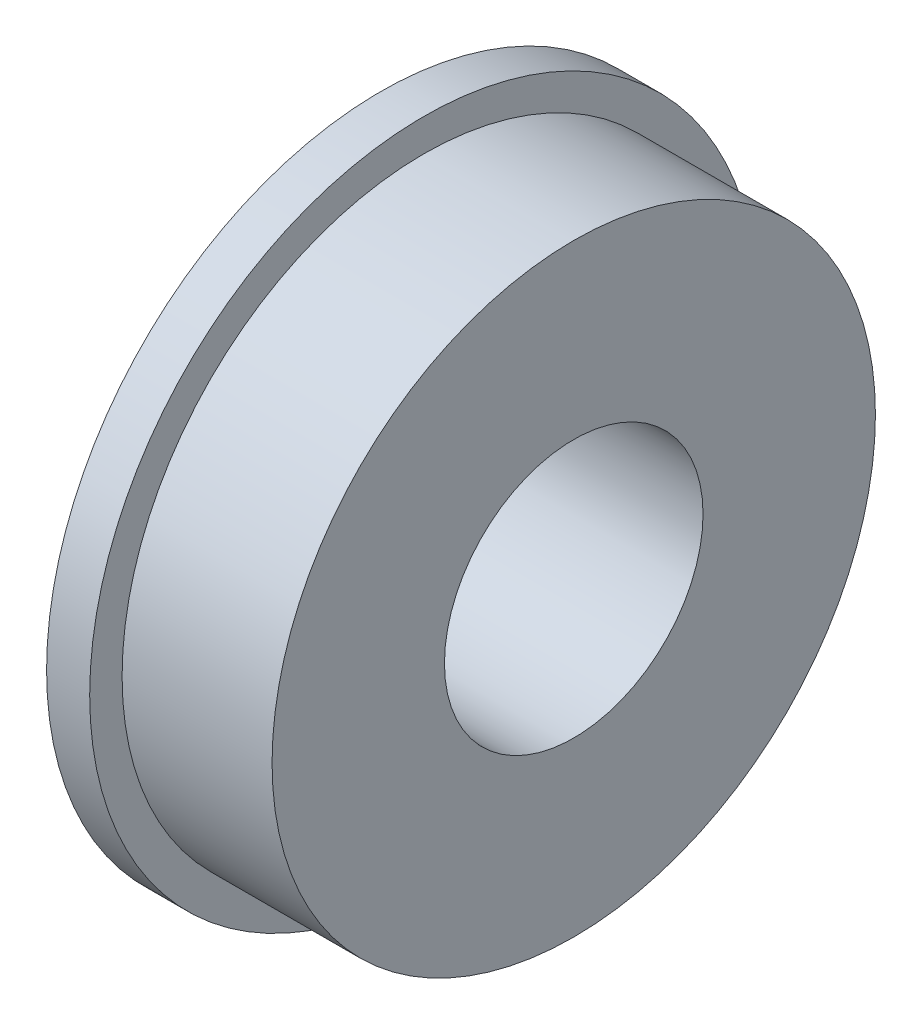
ISO-10303-21;
HEADER;
FILE_DESCRIPTION(('STEP AP214'),'2;1');
FILE_NAME('part.step','',(''),(''),'','','');
FILE_SCHEMA(('AUTOMOTIVE_DESIGN { 1 0 10303 214 1 1 1 1 }'));
ENDSEC;
DATA;
#1=APPLICATION_CONTEXT('core data for automotive mechanical design processes');
#2=APPLICATION_PROTOCOL_DEFINITION('international standard','automotive_design',2000,#1);
#3=PRODUCT_CONTEXT('',#1,'mechanical');
#4=PRODUCT('Part','Part','',(#3));
#5=PRODUCT_RELATED_PRODUCT_CATEGORY('part','',(#4));
#6=PRODUCT_DEFINITION_FORMATION('','',#4);
#7=PRODUCT_DEFINITION_CONTEXT('part definition',#1,'design');
#8=PRODUCT_DEFINITION('design','',#6,#7);
#9=PRODUCT_DEFINITION_SHAPE('','',#8);
#10=(LENGTH_UNIT() NAMED_UNIT(*) SI_UNIT(.MILLI.,.METRE.));
#11=(NAMED_UNIT(*) PLANE_ANGLE_UNIT() SI_UNIT($,.RADIAN.));
#12=(NAMED_UNIT(*) SI_UNIT($,.STERADIAN.) SOLID_ANGLE_UNIT());
#13=UNCERTAINTY_MEASURE_WITH_UNIT(LENGTH_MEASURE(1.E-05),#10,'distance_accuracy_value','');
#14=(GEOMETRIC_REPRESENTATION_CONTEXT(3) GLOBAL_UNCERTAINTY_ASSIGNED_CONTEXT((#13)) GLOBAL_UNIT_ASSIGNED_CONTEXT((#10,
#11,#12)) REPRESENTATION_CONTEXT('',''));
#15=CARTESIAN_POINT('',(0.,0.,0.));
#16=DIRECTION('',(0.,0.,1.));
#17=DIRECTION('',(1.,0.,0.));
#18=AXIS2_PLACEMENT_3D('',#15,#16,#17);
#19=CARTESIAN_POINT('',(0.,0.,0.));
#20=DIRECTION('',(-1.,0.,0.));
#21=DIRECTION('',(0.,0.,1.));
#22=AXIS2_PLACEMENT_3D('',#19,#20,#21);
#23=CYLINDRICAL_SURFACE('',#22,9.906);
#24=CARTESIAN_POINT('',(0.381,0.,0.));
#25=DIRECTION('',(-1.,0.,0.));
#26=DIRECTION('',(0.,0.,1.));
#27=AXIS2_PLACEMENT_3D('',#24,#25,#26);
#28=CIRCLE('',#27,9.906);
#29=CARTESIAN_POINT('',(0.381,0.,9.906));
#30=VERTEX_POINT('',#29);
#31=EDGE_CURVE('E45',#30,#30,#28,.F.);
#32=ORIENTED_EDGE('',*,*,#31,.T.);
#33=EDGE_LOOP('',(#32));
#34=FACE_BOUND('',#33,.T.);
#35=CARTESIAN_POINT('',(0.,0.,0.));
#36=DIRECTION('',(-1.,0.,0.));
#37=DIRECTION('',(0.,0.,1.));
#38=AXIS2_PLACEMENT_3D('',#35,#36,#37);
#39=CIRCLE('',#38,9.906);
#40=CARTESIAN_POINT('',(0.,0.,9.906));
#41=VERTEX_POINT('',#40);
#42=EDGE_CURVE('E17',#41,#41,#39,.T.);
#43=ORIENTED_EDGE('',*,*,#42,.T.);
#44=EDGE_LOOP('',(#43));
#45=FACE_BOUND('',#44,.T.);
#46=ADVANCED_FACE('F14',(#34,#45),#23,.F.);
#47=CARTESIAN_POINT('',(0.,12.3063,0.));
#48=DIRECTION('',(1.,0.,0.));
#49=DIRECTION('',(0.,0.,-1.));
#50=AXIS2_PLACEMENT_3D('',#47,#48,#49);
#51=PLANE('',#50);
#52=CARTESIAN_POINT('',(0.,0.,0.));
#53=DIRECTION('',(-1.,0.,0.));
#54=DIRECTION('',(0.,0.,1.));
#55=AXIS2_PLACEMENT_3D('',#52,#53,#54);
#56=CIRCLE('',#55,12.3063);
#57=CARTESIAN_POINT('',(0.,0.,12.3063));
#58=VERTEX_POINT('',#57);
#59=EDGE_CURVE('E43',#58,#58,#56,.F.);
#60=ORIENTED_EDGE('',*,*,#59,.F.);
#61=EDGE_LOOP('',(#60));
#62=FACE_BOUND('',#61,.T.);
#63=ORIENTED_EDGE('',*,*,#42,.F.);
#64=EDGE_LOOP('',(#63));
#65=FACE_BOUND('',#64,.T.);
#66=ADVANCED_FACE('F53',(#62,#65),#51,.F.);
#67=CARTESIAN_POINT('',(0.381,9.906,0.));
#68=DIRECTION('',(1.,0.,0.));
#69=DIRECTION('',(0.,0.,-1.));
#70=AXIS2_PLACEMENT_3D('',#67,#68,#69);
#71=PLANE('',#70);
#72=ORIENTED_EDGE('',*,*,#31,.F.);
#73=EDGE_LOOP('',(#72));
#74=FACE_BOUND('',#73,.T.);
#75=CARTESIAN_POINT('',(0.381,0.,0.));
#76=DIRECTION('',(-1.,0.,0.));
#77=DIRECTION('',(0.,0.,1.));
#78=AXIS2_PLACEMENT_3D('',#75,#76,#77);
#79=CIRCLE('',#78,6.35);
#80=CARTESIAN_POINT('',(0.381,0.,6.35));
#81=VERTEX_POINT('',#80);
#82=EDGE_CURVE('E40',#81,#81,#79,.T.);
#83=ORIENTED_EDGE('',*,*,#82,.F.);
#84=EDGE_LOOP('',(#83));
#85=FACE_BOUND('',#84,.T.);
#86=ADVANCED_FACE('F55',(#74,#85),#71,.F.);
#87=CARTESIAN_POINT('',(0.,0.,0.));
#88=DIRECTION('',(-1.,0.,0.));
#89=DIRECTION('',(0.,0.,1.));
#90=AXIS2_PLACEMENT_3D('',#87,#88,#89);
#91=CYLINDRICAL_SURFACE('',#90,12.3063);
#92=ORIENTED_EDGE('',*,*,#59,.T.);
#93=EDGE_LOOP('',(#92));
#94=FACE_BOUND('',#93,.T.);
#95=CARTESIAN_POINT('',(1.5875,0.,0.));
#96=DIRECTION('',(-1.,0.,0.));
#97=DIRECTION('',(0.,0.,1.));
#98=AXIS2_PLACEMENT_3D('',#95,#96,#97);
#99=CIRCLE('',#98,12.3063);
#100=CARTESIAN_POINT('',(1.5875,0.,12.3063));
#101=VERTEX_POINT('',#100);
#102=EDGE_CURVE('E37',#101,#101,#99,.T.);
#103=ORIENTED_EDGE('',*,*,#102,.T.);
#104=EDGE_LOOP('',(#103));
#105=FACE_BOUND('',#104,.T.);
#106=ADVANCED_FACE('F62',(#94,#105),#91,.T.);
#107=CARTESIAN_POINT('',(0.,0.,0.));
#108=DIRECTION('',(-1.,0.,0.));
#109=DIRECTION('',(0.,0.,1.));
#110=AXIS2_PLACEMENT_3D('',#107,#108,#109);
#111=CYLINDRICAL_SURFACE('',#110,6.35);
#112=CARTESIAN_POINT('',(0.,0.,0.));
#113=DIRECTION('',(-1.,0.,0.));
#114=DIRECTION('',(0.,0.,1.));
#115=AXIS2_PLACEMENT_3D('',#112,#113,#114);
#116=CIRCLE('',#115,6.35);
#117=CARTESIAN_POINT('',(0.,0.,6.35));
#118=VERTEX_POINT('',#117);
#119=EDGE_CURVE('E34',#118,#118,#116,.F.);
#120=ORIENTED_EDGE('',*,*,#119,.T.);
#121=EDGE_LOOP('',(#120));
#122=FACE_BOUND('',#121,.T.);
#123=ORIENTED_EDGE('',*,*,#82,.T.);
#124=EDGE_LOOP('',(#123));
#125=FACE_BOUND('',#124,.T.);
#126=ADVANCED_FACE('F89',(#122,#125),#111,.T.);
#127=CARTESIAN_POINT('',(1.5875,11.1125,0.));
#128=DIRECTION('',(-1.,0.,0.));
#129=DIRECTION('',(0.,0.,1.));
#130=AXIS2_PLACEMENT_3D('',#127,#128,#129);
#131=PLANE('',#130);
#132=CARTESIAN_POINT('',(1.5875,0.,0.));
#133=DIRECTION('',(-1.,0.,0.));
#134=DIRECTION('',(0.,0.,1.));
#135=AXIS2_PLACEMENT_3D('',#132,#133,#134);
#136=CIRCLE('',#135,11.1125);
#137=CARTESIAN_POINT('',(1.5875,0.,11.1125));
#138=VERTEX_POINT('',#137);
#139=EDGE_CURVE('E31',#138,#138,#136,.F.);
#140=ORIENTED_EDGE('',*,*,#139,.F.);
#141=EDGE_LOOP('',(#140));
#142=FACE_BOUND('',#141,.T.);
#143=ORIENTED_EDGE('',*,*,#102,.F.);
#144=EDGE_LOOP('',(#143));
#145=FACE_BOUND('',#144,.T.);
#146=ADVANCED_FACE('F85',(#142,#145),#131,.F.);
#147=CARTESIAN_POINT('',(0.,6.35,0.));
#148=DIRECTION('',(1.,0.,0.));
#149=DIRECTION('',(0.,0.,-1.));
#150=AXIS2_PLACEMENT_3D('',#147,#148,#149);
#151=PLANE('',#150);
#152=ORIENTED_EDGE('',*,*,#119,.F.);
#153=EDGE_LOOP('',(#152));
#154=FACE_BOUND('',#153,.T.);
#155=CARTESIAN_POINT('',(0.,0.,0.));
#156=DIRECTION('',(-1.,0.,0.));
#157=DIRECTION('',(0.,0.,1.));
#158=AXIS2_PLACEMENT_3D('',#155,#156,#157);
#159=CIRCLE('',#158,4.7625);
#160=CARTESIAN_POINT('',(0.,0.,4.7625));
#161=VERTEX_POINT('',#160);
#162=EDGE_CURVE('E26',#161,#161,#159,.F.);
#163=ORIENTED_EDGE('',*,*,#162,.T.);
#164=EDGE_LOOP('',(#163));
#165=FACE_BOUND('',#164,.T.);
#166=ADVANCED_FACE('F81',(#154,#165),#151,.F.);
#167=CARTESIAN_POINT('',(0.,0.,0.));
#168=DIRECTION('',(-1.,0.,0.));
#169=DIRECTION('',(0.,0.,1.));
#170=AXIS2_PLACEMENT_3D('',#167,#168,#169);
#171=CYLINDRICAL_SURFACE('',#170,11.1125);
#172=ORIENTED_EDGE('',*,*,#139,.T.);
#173=EDGE_LOOP('',(#172));
#174=FACE_BOUND('',#173,.T.);
#175=CARTESIAN_POINT('',(7.112,0.,0.));
#176=DIRECTION('',(-1.,0.,0.));
#177=DIRECTION('',(0.,0.,1.));
#178=AXIS2_PLACEMENT_3D('',#175,#176,#177);
#179=CIRCLE('',#178,11.1125);
#180=CARTESIAN_POINT('',(7.112,0.,11.1125));
#181=VERTEX_POINT('',#180);
#182=EDGE_CURVE('E21',#181,#181,#179,.T.);
#183=ORIENTED_EDGE('',*,*,#182,.T.);
#184=EDGE_LOOP('',(#183));
#185=FACE_BOUND('',#184,.T.);
#186=ADVANCED_FACE('F75',(#174,#185),#171,.T.);
#187=CARTESIAN_POINT('',(0.,0.,0.));
#188=DIRECTION('',(-1.,0.,0.));
#189=DIRECTION('',(0.,0.,1.));
#190=AXIS2_PLACEMENT_3D('',#187,#188,#189);
#191=CYLINDRICAL_SURFACE('',#190,4.7625);
#192=CARTESIAN_POINT('',(7.112,0.,0.));
#193=DIRECTION('',(-1.,0.,0.));
#194=DIRECTION('',(0.,0.,1.));
#195=AXIS2_PLACEMENT_3D('',#192,#193,#194);
#196=CIRCLE('',#195,4.7625);
#197=CARTESIAN_POINT('',(7.112,0.,4.7625));
#198=VERTEX_POINT('',#197);
#199=EDGE_CURVE('E10',#198,#198,#196,.F.);
#200=ORIENTED_EDGE('',*,*,#199,.T.);
#201=EDGE_LOOP('',(#200));
#202=FACE_BOUND('',#201,.T.);
#203=ORIENTED_EDGE('',*,*,#162,.F.);
#204=EDGE_LOOP('',(#203));
#205=FACE_BOUND('',#204,.T.);
#206=ADVANCED_FACE('F69',(#202,#205),#191,.F.);
#207=CARTESIAN_POINT('',(7.112,4.7625,0.));
#208=DIRECTION('',(-1.,0.,0.));
#209=DIRECTION('',(0.,0.,1.));
#210=AXIS2_PLACEMENT_3D('',#207,#208,#209);
#211=PLANE('',#210);
#212=ORIENTED_EDGE('',*,*,#199,.F.);
#213=EDGE_LOOP('',(#212));
#214=FACE_BOUND('',#213,.T.);
#215=ORIENTED_EDGE('',*,*,#182,.F.);
#216=EDGE_LOOP('',(#215));
#217=FACE_BOUND('',#216,.T.);
#218=ADVANCED_FACE('F67',(#214,#217),#211,.F.);
#219=CLOSED_SHELL('',(#46,#66,#86,#106,#126,#146,#166,#186,#206,#218));
#220=MANIFOLD_SOLID_BREP('B1',#219);
#221=ADVANCED_BREP_SHAPE_REPRESENTATION('',(#18,#220),#14);
#222=SHAPE_DEFINITION_REPRESENTATION(#9,#221);
ENDSEC;
END-ISO-10303-21;
